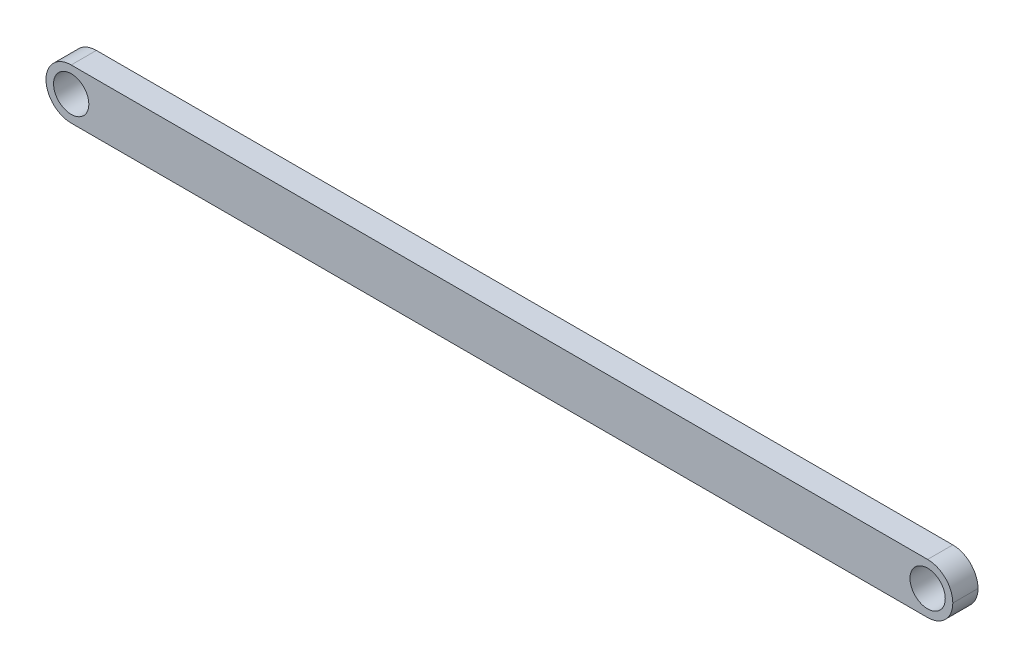
ISO-10303-21;
HEADER;
FILE_DESCRIPTION(('STEP AP214'),'2;1');
FILE_NAME('part.step','',(''),(''),'','','');
FILE_SCHEMA(('AUTOMOTIVE_DESIGN { 1 0 10303 214 1 1 1 1 }'));
ENDSEC;
DATA;
#1=APPLICATION_CONTEXT('core data for automotive mechanical design processes');
#2=APPLICATION_PROTOCOL_DEFINITION('international standard','automotive_design',2000,#1);
#3=PRODUCT_CONTEXT('',#1,'mechanical');
#4=PRODUCT('Part','Part','',(#3));
#5=PRODUCT_RELATED_PRODUCT_CATEGORY('part','',(#4));
#6=PRODUCT_DEFINITION_FORMATION('','',#4);
#7=PRODUCT_DEFINITION_CONTEXT('part definition',#1,'design');
#8=PRODUCT_DEFINITION('design','',#6,#7);
#9=PRODUCT_DEFINITION_SHAPE('','',#8);
#10=(LENGTH_UNIT() NAMED_UNIT(*) SI_UNIT(.MILLI.,.METRE.));
#11=(NAMED_UNIT(*) PLANE_ANGLE_UNIT() SI_UNIT($,.RADIAN.));
#12=(NAMED_UNIT(*) SI_UNIT($,.STERADIAN.) SOLID_ANGLE_UNIT());
#13=UNCERTAINTY_MEASURE_WITH_UNIT(LENGTH_MEASURE(1.E-05),#10,'distance_accuracy_value','');
#14=(GEOMETRIC_REPRESENTATION_CONTEXT(3) GLOBAL_UNCERTAINTY_ASSIGNED_CONTEXT((#13)) GLOBAL_UNIT_ASSIGNED_CONTEXT((#10,
#11,#12)) REPRESENTATION_CONTEXT('',''));
#15=CARTESIAN_POINT('',(0.,0.,0.));
#16=DIRECTION('',(0.,0.,1.));
#17=DIRECTION('',(1.,0.,0.));
#18=AXIS2_PLACEMENT_3D('',#15,#16,#17);
#19=CARTESIAN_POINT('',(0.,0.,10.));
#20=DIRECTION('',(0.,0.,-1.));
#21=DIRECTION('',(-1.,0.,0.));
#22=AXIS2_PLACEMENT_3D('',#19,#20,#21);
#23=PLANE('',#22);
#24=CARTESIAN_POINT('',(170.,0.,10.));
#25=DIRECTION('',(0.,0.,-1.));
#26=DIRECTION('',(-1.,0.,0.));
#27=AXIS2_PLACEMENT_3D('',#24,#25,#26);
#28=CIRCLE('',#27,10.);
#29=CARTESIAN_POINT('',(170.,-10.,10.));
#30=VERTEX_POINT('',#29);
#31=CARTESIAN_POINT('',(180.,0.,10.));
#32=VERTEX_POINT('',#31);
#33=EDGE_CURVE('E136',#30,#32,#28,.F.);
#34=ORIENTED_EDGE('',*,*,#33,.T.);
#35=CARTESIAN_POINT('',(170.,0.,10.));
#36=DIRECTION('',(0.,0.,-1.));
#37=DIRECTION('',(-1.,0.,0.));
#38=AXIS2_PLACEMENT_3D('',#35,#36,#37);
#39=CIRCLE('',#38,10.);
#40=CARTESIAN_POINT('',(170.,10.,10.));
#41=VERTEX_POINT('',#40);
#42=EDGE_CURVE('E138',#32,#41,#39,.F.);
#43=ORIENTED_EDGE('',*,*,#42,.T.);
#44=DIRECTION('',(-1.,0.,0.));
#45=VECTOR('',#44,1.);
#46=CARTESIAN_POINT('',(-180.,10.,10.));
#47=LINE('',#46,#45);
#48=CARTESIAN_POINT('',(-170.,10.,10.));
#49=VERTEX_POINT('',#48);
#50=EDGE_CURVE('E111',#41,#49,#47,.T.);
#51=ORIENTED_EDGE('',*,*,#50,.T.);
#52=CARTESIAN_POINT('',(-170.,0.,10.));
#53=DIRECTION('',(0.,0.,-1.));
#54=DIRECTION('',(-1.,0.,0.));
#55=AXIS2_PLACEMENT_3D('',#52,#53,#54);
#56=CIRCLE('',#55,10.);
#57=CARTESIAN_POINT('',(-180.,0.,10.));
#58=VERTEX_POINT('',#57);
#59=EDGE_CURVE('E101',#49,#58,#56,.F.);
#60=ORIENTED_EDGE('',*,*,#59,.T.);
#61=CARTESIAN_POINT('',(-170.,0.,10.));
#62=DIRECTION('',(0.,0.,-1.));
#63=DIRECTION('',(-1.,0.,0.));
#64=AXIS2_PLACEMENT_3D('',#61,#62,#63);
#65=CIRCLE('',#64,10.);
#66=CARTESIAN_POINT('',(-170.,-10.,10.));
#67=VERTEX_POINT('',#66);
#68=EDGE_CURVE('E59',#58,#67,#65,.F.);
#69=ORIENTED_EDGE('',*,*,#68,.T.);
#70=DIRECTION('',(1.,0.,0.));
#71=VECTOR('',#70,1.);
#72=CARTESIAN_POINT('',(-180.,-10.,10.));
#73=LINE('',#72,#71);
#74=EDGE_CURVE('E126',#67,#30,#73,.T.);
#75=ORIENTED_EDGE('',*,*,#74,.T.);
#76=EDGE_LOOP('',(#34,#43,#51,#60,#69,#75));
#77=FACE_BOUND('',#76,.T.);
#78=CARTESIAN_POINT('',(-170.,0.,10.));
#79=DIRECTION('',(0.,0.,1.));
#80=DIRECTION('',(1.,0.,0.));
#81=AXIS2_PLACEMENT_3D('',#78,#79,#80);
#82=CIRCLE('',#81,7.00000000000001);
#83=CARTESIAN_POINT('',(-163.,0.,10.));
#84=VERTEX_POINT('',#83);
#85=EDGE_CURVE('E119',#84,#84,#82,.T.);
#86=ORIENTED_EDGE('',*,*,#85,.F.);
#87=EDGE_LOOP('',(#86));
#88=FACE_BOUND('',#87,.T.);
#89=CARTESIAN_POINT('',(170.,0.,10.));
#90=DIRECTION('',(0.,0.,1.));
#91=DIRECTION('',(1.,0.,0.));
#92=AXIS2_PLACEMENT_3D('',#89,#90,#91);
#93=CIRCLE('',#92,7.00000000000001);
#94=CARTESIAN_POINT('',(177.,0.,10.));
#95=VERTEX_POINT('',#94);
#96=EDGE_CURVE('E143',#95,#95,#93,.T.);
#97=ORIENTED_EDGE('',*,*,#96,.F.);
#98=EDGE_LOOP('',(#97));
#99=FACE_BOUND('',#98,.T.);
#100=ADVANCED_FACE('F37',(#77,#88,#99),#23,.F.);
#101=CARTESIAN_POINT('',(0.,0.,0.));
#102=DIRECTION('',(0.,0.,-1.));
#103=DIRECTION('',(-1.,0.,0.));
#104=AXIS2_PLACEMENT_3D('',#101,#102,#103);
#105=PLANE('',#104);
#106=CARTESIAN_POINT('',(-170.,0.,0.));
#107=DIRECTION('',(0.,0.,1.));
#108=DIRECTION('',(1.,0.,0.));
#109=AXIS2_PLACEMENT_3D('',#106,#107,#108);
#110=CIRCLE('',#109,7.00000000000001);
#111=CARTESIAN_POINT('',(-163.,0.,0.));
#112=VERTEX_POINT('',#111);
#113=EDGE_CURVE('E123',#112,#112,#110,.T.);
#114=ORIENTED_EDGE('',*,*,#113,.T.);
#115=EDGE_LOOP('',(#114));
#116=FACE_BOUND('',#115,.T.);
#117=DIRECTION('',(-1.,0.,0.));
#118=VECTOR('',#117,1.);
#119=CARTESIAN_POINT('',(-180.,10.,0.));
#120=LINE('',#119,#118);
#121=CARTESIAN_POINT('',(170.,10.,0.));
#122=VERTEX_POINT('',#121);
#123=CARTESIAN_POINT('',(-170.,10.,0.));
#124=VERTEX_POINT('',#123);
#125=EDGE_CURVE('E108',#122,#124,#120,.T.);
#126=ORIENTED_EDGE('',*,*,#125,.F.);
#127=CARTESIAN_POINT('',(170.,0.,0.));
#128=DIRECTION('',(0.,0.,-1.));
#129=DIRECTION('',(-1.,0.,0.));
#130=AXIS2_PLACEMENT_3D('',#127,#128,#129);
#131=CIRCLE('',#130,10.);
#132=CARTESIAN_POINT('',(180.,0.,0.));
#133=VERTEX_POINT('',#132);
#134=EDGE_CURVE('E91',#122,#133,#131,.T.);
#135=ORIENTED_EDGE('',*,*,#134,.T.);
#136=CARTESIAN_POINT('',(170.,0.,0.));
#137=DIRECTION('',(0.,0.,-1.));
#138=DIRECTION('',(-1.,0.,0.));
#139=AXIS2_PLACEMENT_3D('',#136,#137,#138);
#140=CIRCLE('',#139,10.);
#141=CARTESIAN_POINT('',(170.,-10.,0.));
#142=VERTEX_POINT('',#141);
#143=EDGE_CURVE('E102',#133,#142,#140,.T.);
#144=ORIENTED_EDGE('',*,*,#143,.T.);
#145=DIRECTION('',(1.,0.,0.));
#146=VECTOR('',#145,1.);
#147=CARTESIAN_POINT('',(-180.,-10.,0.));
#148=LINE('',#147,#146);
#149=CARTESIAN_POINT('',(-170.,-10.,0.));
#150=VERTEX_POINT('',#149);
#151=EDGE_CURVE('E118',#150,#142,#148,.T.);
#152=ORIENTED_EDGE('',*,*,#151,.F.);
#153=CARTESIAN_POINT('',(-170.,0.,0.));
#154=DIRECTION('',(0.,0.,-1.));
#155=DIRECTION('',(-1.,0.,0.));
#156=AXIS2_PLACEMENT_3D('',#153,#154,#155);
#157=CIRCLE('',#156,10.);
#158=CARTESIAN_POINT('',(-180.,0.,0.));
#159=VERTEX_POINT('',#158);
#160=EDGE_CURVE('E131',#150,#159,#157,.T.);
#161=ORIENTED_EDGE('',*,*,#160,.T.);
#162=CARTESIAN_POINT('',(-170.,0.,0.));
#163=DIRECTION('',(0.,0.,-1.));
#164=DIRECTION('',(-1.,0.,0.));
#165=AXIS2_PLACEMENT_3D('',#162,#163,#164);
#166=CIRCLE('',#165,10.);
#167=EDGE_CURVE('E112',#159,#124,#166,.T.);
#168=ORIENTED_EDGE('',*,*,#167,.T.);
#169=EDGE_LOOP('',(#126,#135,#144,#152,#161,#168));
#170=FACE_BOUND('',#169,.T.);
#171=CARTESIAN_POINT('',(170.,0.,0.));
#172=DIRECTION('',(0.,0.,1.));
#173=DIRECTION('',(1.,0.,0.));
#174=AXIS2_PLACEMENT_3D('',#171,#172,#173);
#175=CIRCLE('',#174,7.00000000000001);
#176=CARTESIAN_POINT('',(177.,0.,0.));
#177=VERTEX_POINT('',#176);
#178=EDGE_CURVE('E141',#177,#177,#175,.T.);
#179=ORIENTED_EDGE('',*,*,#178,.T.);
#180=EDGE_LOOP('',(#179));
#181=FACE_BOUND('',#180,.T.);
#182=ADVANCED_FACE('F115',(#116,#170,#181),#105,.T.);
#183=CARTESIAN_POINT('',(-180.,10.,10.));
#184=DIRECTION('',(0.,-1.,0.));
#185=DIRECTION('',(0.,0.,-1.));
#186=AXIS2_PLACEMENT_3D('',#183,#184,#185);
#187=PLANE('',#186);
#188=ORIENTED_EDGE('',*,*,#50,.F.);
#189=DIRECTION('',(0.,0.,-1.));
#190=VECTOR('',#189,1.);
#191=CARTESIAN_POINT('',(170.,10.,10.));
#192=LINE('',#191,#190);
#193=EDGE_CURVE('E95',#41,#122,#192,.T.);
#194=ORIENTED_EDGE('',*,*,#193,.T.);
#195=ORIENTED_EDGE('',*,*,#125,.T.);
#196=DIRECTION('',(0.,0.,-1.));
#197=VECTOR('',#196,1.);
#198=CARTESIAN_POINT('',(-170.,10.,10.));
#199=LINE('',#198,#197);
#200=EDGE_CURVE('E113',#124,#49,#199,.F.);
#201=ORIENTED_EDGE('',*,*,#200,.T.);
#202=EDGE_LOOP('',(#188,#194,#195,#201));
#203=FACE_BOUND('',#202,.T.);
#204=ADVANCED_FACE('F107',(#203),#187,.F.);
#205=CARTESIAN_POINT('',(-180.,-10.,10.));
#206=DIRECTION('',(0.,1.,0.));
#207=DIRECTION('',(0.,0.,1.));
#208=AXIS2_PLACEMENT_3D('',#205,#206,#207);
#209=PLANE('',#208);
#210=ORIENTED_EDGE('',*,*,#151,.T.);
#211=DIRECTION('',(0.,0.,-1.));
#212=VECTOR('',#211,1.);
#213=CARTESIAN_POINT('',(170.,-10.,10.));
#214=LINE('',#213,#212);
#215=EDGE_CURVE('E11',#142,#30,#214,.F.);
#216=ORIENTED_EDGE('',*,*,#215,.T.);
#217=ORIENTED_EDGE('',*,*,#74,.F.);
#218=DIRECTION('',(0.,0.,-1.));
#219=VECTOR('',#218,1.);
#220=CARTESIAN_POINT('',(-170.,-10.,10.));
#221=LINE('',#220,#219);
#222=EDGE_CURVE('E46',#67,#150,#221,.T.);
#223=ORIENTED_EDGE('',*,*,#222,.T.);
#224=EDGE_LOOP('',(#210,#216,#217,#223));
#225=FACE_BOUND('',#224,.T.);
#226=ADVANCED_FACE('F173',(#225),#209,.F.);
#227=CARTESIAN_POINT('',(-170.,0.,10.));
#228=DIRECTION('',(0.,0.,-1.));
#229=DIRECTION('',(-1.,0.,0.));
#230=AXIS2_PLACEMENT_3D('',#227,#228,#229);
#231=CYLINDRICAL_SURFACE('',#230,7.00000000000001);
#232=ORIENTED_EDGE('',*,*,#85,.T.);
#233=EDGE_LOOP('',(#232));
#234=FACE_BOUND('',#233,.T.);
#235=ORIENTED_EDGE('',*,*,#113,.F.);
#236=EDGE_LOOP('',(#235));
#237=FACE_BOUND('',#236,.T.);
#238=ADVANCED_FACE('F170',(#234,#237),#231,.F.);
#239=CARTESIAN_POINT('',(170.,0.,10.));
#240=DIRECTION('',(0.,0.,-1.));
#241=DIRECTION('',(-1.,0.,0.));
#242=AXIS2_PLACEMENT_3D('',#239,#240,#241);
#243=CYLINDRICAL_SURFACE('',#242,7.00000000000001);
#244=ORIENTED_EDGE('',*,*,#96,.T.);
#245=EDGE_LOOP('',(#244));
#246=FACE_BOUND('',#245,.T.);
#247=ORIENTED_EDGE('',*,*,#178,.F.);
#248=EDGE_LOOP('',(#247));
#249=FACE_BOUND('',#248,.T.);
#250=ADVANCED_FACE('F159',(#246,#249),#243,.F.);
#251=CARTESIAN_POINT('',(170.,0.,10.));
#252=DIRECTION('',(0.,0.,-1.));
#253=DIRECTION('',(-1.,0.,0.));
#254=AXIS2_PLACEMENT_3D('',#251,#252,#253);
#255=CYLINDRICAL_SURFACE('',#254,10.);
#256=DIRECTION('',(0.,0.,-1.));
#257=VECTOR('',#256,1.);
#258=CARTESIAN_POINT('',(180.,0.,10.));
#259=LINE('',#258,#257);
#260=EDGE_CURVE('E97',#32,#133,#259,.T.);
#261=ORIENTED_EDGE('',*,*,#260,.F.);
#262=ORIENTED_EDGE('',*,*,#33,.F.);
#263=ORIENTED_EDGE('',*,*,#215,.F.);
#264=ORIENTED_EDGE('',*,*,#143,.F.);
#265=EDGE_LOOP('',(#261,#262,#263,#264));
#266=FACE_BOUND('',#265,.T.);
#267=ADVANCED_FACE('F180',(#266),#255,.T.);
#268=CARTESIAN_POINT('',(170.,0.,10.));
#269=DIRECTION('',(0.,0.,-1.));
#270=DIRECTION('',(-1.,0.,0.));
#271=AXIS2_PLACEMENT_3D('',#268,#269,#270);
#272=CYLINDRICAL_SURFACE('',#271,10.);
#273=ORIENTED_EDGE('',*,*,#42,.F.);
#274=ORIENTED_EDGE('',*,*,#260,.T.);
#275=ORIENTED_EDGE('',*,*,#134,.F.);
#276=ORIENTED_EDGE('',*,*,#193,.F.);
#277=EDGE_LOOP('',(#273,#274,#275,#276));
#278=FACE_BOUND('',#277,.T.);
#279=ADVANCED_FACE('F94',(#278),#272,.T.);
#280=CARTESIAN_POINT('',(-170.,0.,10.));
#281=DIRECTION('',(0.,0.,-1.));
#282=DIRECTION('',(-1.,0.,0.));
#283=AXIS2_PLACEMENT_3D('',#280,#281,#282);
#284=CYLINDRICAL_SURFACE('',#283,10.);
#285=DIRECTION('',(0.,0.,-1.));
#286=VECTOR('',#285,1.);
#287=CARTESIAN_POINT('',(-180.,0.,10.));
#288=LINE('',#287,#286);
#289=EDGE_CURVE('E41',#58,#159,#288,.T.);
#290=ORIENTED_EDGE('',*,*,#289,.F.);
#291=ORIENTED_EDGE('',*,*,#59,.F.);
#292=ORIENTED_EDGE('',*,*,#200,.F.);
#293=ORIENTED_EDGE('',*,*,#167,.F.);
#294=EDGE_LOOP('',(#290,#291,#292,#293));
#295=FACE_BOUND('',#294,.T.);
#296=ADVANCED_FACE('F39',(#295),#284,.T.);
#297=CARTESIAN_POINT('',(-170.,0.,10.));
#298=DIRECTION('',(0.,0.,-1.));
#299=DIRECTION('',(-1.,0.,0.));
#300=AXIS2_PLACEMENT_3D('',#297,#298,#299);
#301=CYLINDRICAL_SURFACE('',#300,10.);
#302=ORIENTED_EDGE('',*,*,#68,.F.);
#303=ORIENTED_EDGE('',*,*,#289,.T.);
#304=ORIENTED_EDGE('',*,*,#160,.F.);
#305=ORIENTED_EDGE('',*,*,#222,.F.);
#306=EDGE_LOOP('',(#302,#303,#304,#305));
#307=FACE_BOUND('',#306,.T.);
#308=ADVANCED_FACE('F148',(#307),#301,.T.);
#309=CLOSED_SHELL('',(#100,#182,#204,#226,#238,#250,#267,#279,#296,#308));
#310=MANIFOLD_SOLID_BREP('B2',#309);
#311=ADVANCED_BREP_SHAPE_REPRESENTATION('',(#18,#310),#14);
#312=SHAPE_DEFINITION_REPRESENTATION(#9,#311);
ENDSEC;
END-ISO-10303-21;
